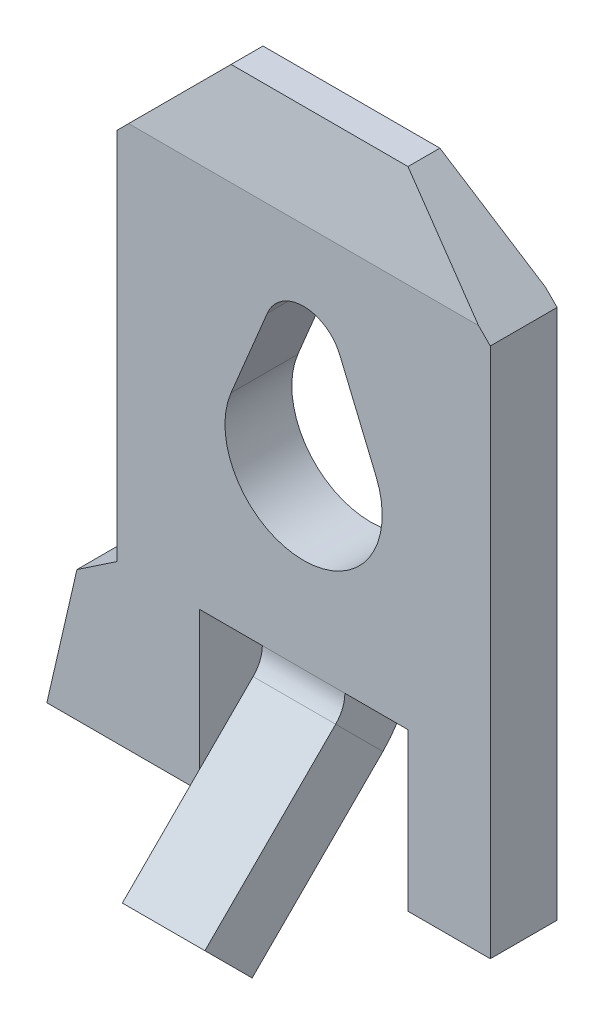
ISO-10303-21;
HEADER;
FILE_DESCRIPTION(('STEP AP214'),'2;1');
FILE_NAME('part.step','',(''),(''),'','','');
FILE_SCHEMA(('AUTOMOTIVE_DESIGN { 1 0 10303 214 1 1 1 1 }'));
ENDSEC;
DATA;
#1=APPLICATION_CONTEXT('core data for automotive mechanical design processes');
#2=APPLICATION_PROTOCOL_DEFINITION('international standard','automotive_design',2000,#1);
#3=PRODUCT_CONTEXT('',#1,'mechanical');
#4=PRODUCT('Part','Part','',(#3));
#5=PRODUCT_RELATED_PRODUCT_CATEGORY('part','',(#4));
#6=PRODUCT_DEFINITION_FORMATION('','',#4);
#7=PRODUCT_DEFINITION_CONTEXT('part definition',#1,'design');
#8=PRODUCT_DEFINITION('design','',#6,#7);
#9=PRODUCT_DEFINITION_SHAPE('','',#8);
#10=(LENGTH_UNIT() NAMED_UNIT(*) SI_UNIT(.MILLI.,.METRE.));
#11=(NAMED_UNIT(*) PLANE_ANGLE_UNIT() SI_UNIT($,.RADIAN.));
#12=(NAMED_UNIT(*) SI_UNIT($,.STERADIAN.) SOLID_ANGLE_UNIT());
#13=UNCERTAINTY_MEASURE_WITH_UNIT(LENGTH_MEASURE(1.E-05),#10,'distance_accuracy_value','');
#14=(GEOMETRIC_REPRESENTATION_CONTEXT(3) GLOBAL_UNCERTAINTY_ASSIGNED_CONTEXT((#13)) GLOBAL_UNIT_ASSIGNED_CONTEXT((#10,
#11,#12)) REPRESENTATION_CONTEXT('',''));
#15=CARTESIAN_POINT('',(0.,0.,0.));
#16=DIRECTION('',(0.,0.,1.));
#17=DIRECTION('',(1.,0.,0.));
#18=AXIS2_PLACEMENT_3D('',#15,#16,#17);
#19=CARTESIAN_POINT('',(4.75,0.149999999999999,0.));
#20=DIRECTION('',(0.,0.,1.));
#21=DIRECTION('',(0.,-1.,0.));
#22=AXIS2_PLACEMENT_3D('',#19,#20,#21);
#23=PLANE('',#22);
#24=DIRECTION('',(0.384813689288075,-0.922994271128755,0.));
#25=VECTOR('',#24,1.);
#26=CARTESIAN_POINT('',(2.84243697464802,5.82748992853653,0.));
#27=LINE('',#26,#25);
#28=CARTESIAN_POINT('',(2.84243697464802,5.82748992853653,0.));
#29=VERTEX_POINT('',#28);
#30=CARTESIAN_POINT('',(3.29799427112875,4.73481368928808,0.));
#31=VERTEX_POINT('',#30);
#32=EDGE_CURVE('E312',#29,#31,#27,.T.);
#33=ORIENTED_EDGE('',*,*,#32,.F.);
#34=CARTESIAN_POINT('',(2.375,5.65,0.));
#35=DIRECTION('',(0.,0.,1.));
#36=DIRECTION('',(0.,-1.,0.));
#37=AXIS2_PLACEMENT_3D('',#34,#35,#36);
#38=CIRCLE('',#37,0.5);
#39=CARTESIAN_POINT('',(1.91346153846154,5.84230769230769,0.));
#40=VERTEX_POINT('',#39);
#41=EDGE_CURVE('E315',#40,#29,#38,.F.);
#42=ORIENTED_EDGE('',*,*,#41,.F.);
#43=DIRECTION('',(0.384615384615385,0.923076923076923,0.));
#44=VECTOR('',#43,1.);
#45=CARTESIAN_POINT('',(1.91346153846154,5.84230769230769,0.));
#46=LINE('',#45,#44);
#47=CARTESIAN_POINT('',(1.45192307692308,4.73461538461538,0.));
#48=VERTEX_POINT('',#47);
#49=EDGE_CURVE('E317',#48,#40,#46,.T.);
#50=ORIENTED_EDGE('',*,*,#49,.F.);
#51=CARTESIAN_POINT('',(2.375,4.35,0.));
#52=DIRECTION('',(0.,0.,1.));
#53=DIRECTION('',(0.,-1.,0.));
#54=AXIS2_PLACEMENT_3D('',#51,#52,#53);
#55=CIRCLE('',#54,0.999999999999999);
#56=EDGE_CURVE('E309',#31,#48,#55,.F.);
#57=ORIENTED_EDGE('',*,*,#56,.F.);
#58=EDGE_LOOP('',(#33,#42,#50,#57));
#59=FACE_BOUND('',#58,.T.);
#60=DIRECTION('',(1.,0.,0.));
#61=VECTOR('',#60,1.);
#62=CARTESIAN_POINT('',(2.9,2.15,0.));
#63=LINE('',#62,#61);
#64=CARTESIAN_POINT('',(2.9,2.15,0.));
#65=VERTEX_POINT('',#64);
#66=CARTESIAN_POINT('',(3.7,2.15,0.));
#67=VERTEX_POINT('',#66);
#68=EDGE_CURVE('E276',#65,#67,#63,.T.);
#69=ORIENTED_EDGE('',*,*,#68,.F.);
#70=DIRECTION('',(-1.,0.,0.));
#71=VECTOR('',#70,1.);
#72=CARTESIAN_POINT('',(4.75,2.15,0.));
#73=LINE('',#72,#71);
#74=CARTESIAN_POINT('',(1.85000000000001,2.15,0.));
#75=VERTEX_POINT('',#74);
#76=EDGE_CURVE('E51',#65,#75,#73,.T.);
#77=ORIENTED_EDGE('',*,*,#76,.T.);
#78=DIRECTION('',(1.,0.,0.));
#79=VECTOR('',#78,1.);
#80=CARTESIAN_POINT('',(1.85,2.15,0.));
#81=LINE('',#80,#79);
#82=CARTESIAN_POINT('',(1.05,2.15,0.));
#83=VERTEX_POINT('',#82);
#84=EDGE_CURVE('E287',#83,#75,#81,.T.);
#85=ORIENTED_EDGE('',*,*,#84,.F.);
#86=DIRECTION('',(0.,1.,0.));
#87=VECTOR('',#86,1.);
#88=CARTESIAN_POINT('',(1.05,2.15,0.));
#89=LINE('',#88,#87);
#90=CARTESIAN_POINT('',(1.05,0.149999999999999,0.));
#91=VERTEX_POINT('',#90);
#92=EDGE_CURVE('E284',#91,#83,#89,.T.);
#93=ORIENTED_EDGE('',*,*,#92,.F.);
#94=DIRECTION('',(-1.,0.,0.));
#95=VECTOR('',#94,1.);
#96=CARTESIAN_POINT('',(4.75,0.149999999999999,0.));
#97=LINE('',#96,#95);
#98=CARTESIAN_POINT('',(-0.890356386047537,0.149999999999998,0.));
#99=VERTEX_POINT('',#98);
#100=EDGE_CURVE('E381',#91,#99,#97,.T.);
#101=ORIENTED_EDGE('',*,*,#100,.T.);
#102=DIRECTION('',(0.224692209858573,0.974429787531596,0.));
#103=VECTOR('',#102,1.);
#104=CARTESIAN_POINT('',(-0.507898340442458,1.80861785930754,0.));
#105=LINE('',#104,#103);
#106=CARTESIAN_POINT('',(-0.507898340442458,1.80861785930754,0.));
#107=VERTEX_POINT('',#106);
#108=EDGE_CURVE('E230',#99,#107,#105,.T.);
#109=ORIENTED_EDGE('',*,*,#108,.T.);
#110=DIRECTION('',(0.829945240760083,0.557844868525011,0.));
#111=VECTOR('',#110,1.);
#112=CARTESIAN_POINT('',(0.,2.15,0.));
#113=LINE('',#112,#111);
#114=CARTESIAN_POINT('',(0.,2.15,0.));
#115=VERTEX_POINT('',#114);
#116=EDGE_CURVE('E208',#107,#115,#113,.T.);
#117=ORIENTED_EDGE('',*,*,#116,.T.);
#118=DIRECTION('',(0.,1.,0.));
#119=VECTOR('',#118,1.);
#120=CARTESIAN_POINT('',(0.,0.149999999999999,0.));
#121=LINE('',#120,#119);
#122=CARTESIAN_POINT('',(0.,6.9,0.));
#123=VERTEX_POINT('',#122);
#124=EDGE_CURVE('E371',#115,#123,#121,.T.);
#125=ORIENTED_EDGE('',*,*,#124,.T.);
#126=DIRECTION('',(-0.707106781186548,-0.707106781186548,0.));
#127=VECTOR('',#126,1.);
#128=CARTESIAN_POINT('',(0.,6.9,0.));
#129=LINE('',#128,#127);
#130=CARTESIAN_POINT('',(0.15,7.05,0.));
#131=VERTEX_POINT('',#130);
#132=EDGE_CURVE('E345',#131,#123,#129,.T.);
#133=ORIENTED_EDGE('',*,*,#132,.F.);
#134=DIRECTION('',(-1.,0.,0.));
#135=VECTOR('',#134,1.);
#136=CARTESIAN_POINT('',(4.75,7.05,0.));
#137=LINE('',#136,#135);
#138=CARTESIAN_POINT('',(4.6,7.05,0.));
#139=VERTEX_POINT('',#138);
#140=EDGE_CURVE('E376',#139,#131,#137,.T.);
#141=ORIENTED_EDGE('',*,*,#140,.F.);
#142=DIRECTION('',(-0.707106781186548,0.707106781186548,0.));
#143=VECTOR('',#142,1.);
#144=CARTESIAN_POINT('',(3.5,8.15,0.));
#145=LINE('',#144,#143);
#146=CARTESIAN_POINT('',(4.75,6.9,0.));
#147=VERTEX_POINT('',#146);
#148=EDGE_CURVE('E341',#147,#139,#145,.T.);
#149=ORIENTED_EDGE('',*,*,#148,.F.);
#150=DIRECTION('',(0.,1.,0.));
#151=VECTOR('',#150,1.);
#152=CARTESIAN_POINT('',(4.75,0.149999999999999,0.));
#153=LINE('',#152,#151);
#154=CARTESIAN_POINT('',(4.75,0.149999999999999,0.));
#155=VERTEX_POINT('',#154);
#156=EDGE_CURVE('E373',#155,#147,#153,.T.);
#157=ORIENTED_EDGE('',*,*,#156,.F.);
#158=CARTESIAN_POINT('',(3.7,0.149999999999999,0.));
#159=VERTEX_POINT('',#158);
#160=EDGE_CURVE('E382',#155,#159,#97,.T.);
#161=ORIENTED_EDGE('',*,*,#160,.T.);
#162=DIRECTION('',(0.,-1.,0.));
#163=VECTOR('',#162,1.);
#164=CARTESIAN_POINT('',(3.7,2.15,0.));
#165=LINE('',#164,#163);
#166=EDGE_CURVE('E301',#67,#159,#165,.T.);
#167=ORIENTED_EDGE('',*,*,#166,.F.);
#168=EDGE_LOOP('',(#69,#77,#85,#93,#101,#109,#117,#125,#133,#141,#149,#157,#161,#167));
#169=FACE_BOUND('',#168,.T.);
#170=ADVANCED_FACE('F44',(#59,#169),#23,.F.);
#171=CARTESIAN_POINT('',(4.75,7.05,0.85));
#172=DIRECTION('',(0.,0.,-1.));
#173=DIRECTION('',(0.,1.,0.));
#174=AXIS2_PLACEMENT_3D('',#171,#172,#173);
#175=PLANE('',#174);
#176=DIRECTION('',(-0.384615384615385,-0.923076923076923,0.));
#177=VECTOR('',#176,1.);
#178=CARTESIAN_POINT('',(1.91346153846154,5.84230769230769,0.849999999999999));
#179=LINE('',#178,#177);
#180=CARTESIAN_POINT('',(1.91346153846154,5.84230769230769,0.85));
#181=VERTEX_POINT('',#180);
#182=CARTESIAN_POINT('',(1.45192307692308,4.73461538461538,0.849999999999999));
#183=VERTEX_POINT('',#182);
#184=EDGE_CURVE('E319',#181,#183,#179,.T.);
#185=ORIENTED_EDGE('',*,*,#184,.F.);
#186=CARTESIAN_POINT('',(2.375,5.65,0.849999999999999));
#187=DIRECTION('',(0.,0.,1.));
#188=DIRECTION('',(1.,0.,0.));
#189=AXIS2_PLACEMENT_3D('',#186,#187,#188);
#190=CIRCLE('',#189,0.5);
#191=CARTESIAN_POINT('',(2.84243697464802,5.82748992853653,0.849999999999999));
#192=VERTEX_POINT('',#191);
#193=EDGE_CURVE('E295',#192,#181,#190,.T.);
#194=ORIENTED_EDGE('',*,*,#193,.F.);
#195=DIRECTION('',(-0.384813689288075,0.922994271128755,0.));
#196=VECTOR('',#195,1.);
#197=CARTESIAN_POINT('',(2.84243697464802,5.82748992853653,0.849999999999999));
#198=LINE('',#197,#196);
#199=CARTESIAN_POINT('',(3.29799427112875,4.73481368928808,0.849999999999999));
#200=VERTEX_POINT('',#199);
#201=EDGE_CURVE('E325',#200,#192,#198,.T.);
#202=ORIENTED_EDGE('',*,*,#201,.F.);
#203=CARTESIAN_POINT('',(2.375,4.35,0.849999999999999));
#204=DIRECTION('',(0.,0.,1.));
#205=DIRECTION('',(1.,0.,0.));
#206=AXIS2_PLACEMENT_3D('',#203,#204,#205);
#207=CIRCLE('',#206,0.999999999999999);
#208=EDGE_CURVE('E322',#183,#200,#207,.T.);
#209=ORIENTED_EDGE('',*,*,#208,.F.);
#210=EDGE_LOOP('',(#185,#194,#202,#209));
#211=FACE_BOUND('',#210,.T.);
#212=DIRECTION('',(-1.,0.,0.));
#213=VECTOR('',#212,1.);
#214=CARTESIAN_POINT('',(1.85,2.15,0.85));
#215=LINE('',#214,#213);
#216=CARTESIAN_POINT('',(1.85000000000001,2.15,0.849999999999999));
#217=VERTEX_POINT('',#216);
#218=CARTESIAN_POINT('',(1.05,2.15,0.85));
#219=VERTEX_POINT('',#218);
#220=EDGE_CURVE('E280',#217,#219,#215,.T.);
#221=ORIENTED_EDGE('',*,*,#220,.F.);
#222=DIRECTION('',(1.,0.,0.));
#223=VECTOR('',#222,1.);
#224=CARTESIAN_POINT('',(4.75,2.15,0.849999999999999));
#225=LINE('',#224,#223);
#226=CARTESIAN_POINT('',(2.9,2.15,0.849999999999999));
#227=VERTEX_POINT('',#226);
#228=EDGE_CURVE('E398',#217,#227,#225,.T.);
#229=ORIENTED_EDGE('',*,*,#228,.T.);
#230=DIRECTION('',(-1.,0.,0.));
#231=VECTOR('',#230,1.);
#232=CARTESIAN_POINT('',(2.9,2.15,0.85));
#233=LINE('',#232,#231);
#234=CARTESIAN_POINT('',(3.7,2.15,0.85));
#235=VERTEX_POINT('',#234);
#236=EDGE_CURVE('E288',#235,#227,#233,.T.);
#237=ORIENTED_EDGE('',*,*,#236,.F.);
#238=DIRECTION('',(0.,1.,0.));
#239=VECTOR('',#238,1.);
#240=CARTESIAN_POINT('',(3.7,2.15,0.85));
#241=LINE('',#240,#239);
#242=CARTESIAN_POINT('',(3.7,0.149999999999999,0.849999999999999));
#243=VERTEX_POINT('',#242);
#244=EDGE_CURVE('E296',#243,#235,#241,.T.);
#245=ORIENTED_EDGE('',*,*,#244,.F.);
#246=DIRECTION('',(-1.,0.,0.));
#247=VECTOR('',#246,1.);
#248=CARTESIAN_POINT('',(4.75,0.149999999999999,0.849999999999999));
#249=LINE('',#248,#247);
#250=CARTESIAN_POINT('',(4.75,0.149999999999999,0.849999999999999));
#251=VERTEX_POINT('',#250);
#252=EDGE_CURVE('E386',#251,#243,#249,.T.);
#253=ORIENTED_EDGE('',*,*,#252,.F.);
#254=DIRECTION('',(0.,-1.,0.));
#255=VECTOR('',#254,1.);
#256=CARTESIAN_POINT('',(4.75,7.05,0.85));
#257=LINE('',#256,#255);
#258=CARTESIAN_POINT('',(4.75,6.9,0.85));
#259=VERTEX_POINT('',#258);
#260=EDGE_CURVE('E368',#259,#251,#257,.T.);
#261=ORIENTED_EDGE('',*,*,#260,.F.);
#262=DIRECTION('',(0.707106781186548,-0.707106781186548,0.));
#263=VECTOR('',#262,1.);
#264=CARTESIAN_POINT('',(3.5,8.15,0.849999999999999));
#265=LINE('',#264,#263);
#266=CARTESIAN_POINT('',(4.6,7.05,0.849999999999999));
#267=VERTEX_POINT('',#266);
#268=EDGE_CURVE('E337',#267,#259,#265,.T.);
#269=ORIENTED_EDGE('',*,*,#268,.F.);
#270=DIRECTION('',(-1.,0.,0.));
#271=VECTOR('',#270,1.);
#272=CARTESIAN_POINT('',(4.75,7.05,0.85));
#273=LINE('',#272,#271);
#274=CARTESIAN_POINT('',(0.15,7.05,0.849999999999999));
#275=VERTEX_POINT('',#274);
#276=EDGE_CURVE('E389',#267,#275,#273,.T.);
#277=ORIENTED_EDGE('',*,*,#276,.T.);
#278=DIRECTION('',(0.707106781186547,0.707106781186548,0.));
#279=VECTOR('',#278,1.);
#280=CARTESIAN_POINT('',(0.,6.9,0.849999999999999));
#281=LINE('',#280,#279);
#282=CARTESIAN_POINT('',(0.,6.9,0.849999999999999));
#283=VERTEX_POINT('',#282);
#284=EDGE_CURVE('E338',#283,#275,#281,.T.);
#285=ORIENTED_EDGE('',*,*,#284,.F.);
#286=DIRECTION('',(0.,-1.,0.));
#287=VECTOR('',#286,1.);
#288=CARTESIAN_POINT('',(0.,7.05,0.85));
#289=LINE('',#288,#287);
#290=CARTESIAN_POINT('',(0.,2.15,0.849999999999999));
#291=VERTEX_POINT('',#290);
#292=EDGE_CURVE('E227',#283,#291,#289,.T.);
#293=ORIENTED_EDGE('',*,*,#292,.T.);
#294=DIRECTION('',(-0.829945240760083,-0.557844868525011,0.));
#295=VECTOR('',#294,1.);
#296=CARTESIAN_POINT('',(0.,2.15,0.849999999999999));
#297=LINE('',#296,#295);
#298=CARTESIAN_POINT('',(-0.507898340442458,1.80861785930754,0.849999999999999));
#299=VERTEX_POINT('',#298);
#300=EDGE_CURVE('E58',#291,#299,#297,.T.);
#301=ORIENTED_EDGE('',*,*,#300,.T.);
#302=DIRECTION('',(-0.224692209858573,-0.974429787531596,0.));
#303=VECTOR('',#302,1.);
#304=CARTESIAN_POINT('',(-0.507898340442458,1.80861785930754,0.849999999999999));
#305=LINE('',#304,#303);
#306=CARTESIAN_POINT('',(-0.890356386047537,0.149999999999998,0.849999999999999));
#307=VERTEX_POINT('',#306);
#308=EDGE_CURVE('E216',#299,#307,#305,.T.);
#309=ORIENTED_EDGE('',*,*,#308,.T.);
#310=CARTESIAN_POINT('',(1.05,0.149999999999999,0.849999999999999));
#311=VERTEX_POINT('',#310);
#312=EDGE_CURVE('E385',#311,#307,#249,.T.);
#313=ORIENTED_EDGE('',*,*,#312,.F.);
#314=DIRECTION('',(0.,-1.,0.));
#315=VECTOR('',#314,1.);
#316=CARTESIAN_POINT('',(1.05,2.15,0.85));
#317=LINE('',#316,#315);
#318=EDGE_CURVE('E282',#219,#311,#317,.T.);
#319=ORIENTED_EDGE('',*,*,#318,.F.);
#320=EDGE_LOOP('',(#221,#229,#237,#245,#253,#261,#269,#277,#285,#293,#301,#309,#313,#319));
#321=FACE_BOUND('',#320,.T.);
#322=ADVANCED_FACE('F224',(#211,#321),#175,.F.);
#323=CARTESIAN_POINT('',(4.75,0.149999999999999,0.));
#324=DIRECTION('',(0.,1.,0.));
#325=DIRECTION('',(0.,0.,1.));
#326=AXIS2_PLACEMENT_3D('',#323,#324,#325);
#327=PLANE('',#326);
#328=ORIENTED_EDGE('',*,*,#100,.F.);
#329=DIRECTION('',(0.,0.,-1.));
#330=VECTOR('',#329,1.);
#331=CARTESIAN_POINT('',(1.05,0.149999999999999,3.0040659228538));
#332=LINE('',#331,#330);
#333=EDGE_CURVE('E291',#311,#91,#332,.T.);
#334=ORIENTED_EDGE('',*,*,#333,.F.);
#335=ORIENTED_EDGE('',*,*,#312,.T.);
#336=DIRECTION('',(0.,0.,1.));
#337=VECTOR('',#336,1.);
#338=CARTESIAN_POINT('',(-0.890356386047537,0.149999999999998,-2.18923148483107));
#339=LINE('',#338,#337);
#340=EDGE_CURVE('E211',#99,#307,#339,.T.);
#341=ORIENTED_EDGE('',*,*,#340,.F.);
#342=EDGE_LOOP('',(#328,#334,#335,#341));
#343=FACE_BOUND('',#342,.T.);
#344=ADVANCED_FACE('F456',(#343),#327,.F.);
#345=CARTESIAN_POINT('',(4.75,7.05,0.));
#346=DIRECTION('',(0.,-0.214348018272916,0.976757353216485));
#347=DIRECTION('',(0.,-0.976757353216485,-0.214348018272916));
#348=AXIS2_PLACEMENT_3D('',#345,#346,#347);
#349=PLANE('',#348);
#350=ORIENTED_EDGE('',*,*,#140,.T.);
#351=DIRECTION('',(0.698744344369524,0.698744344369524,0.153338457091523));
#352=VECTOR('',#351,1.);
#353=CARTESIAN_POINT('',(2.39592083042662,9.29592083042662,0.492864146468432));
#354=LINE('',#353,#352);
#355=CARTESIAN_POINT('',(1.25,8.15,0.241393442622949));
#356=VERTEX_POINT('',#355);
#357=EDGE_CURVE('E359',#131,#356,#354,.T.);
#358=ORIENTED_EDGE('',*,*,#357,.T.);
#359=DIRECTION('',(-1.,0.,0.));
#360=VECTOR('',#359,1.);
#361=CARTESIAN_POINT('',(4.75,8.15,0.241393442622949));
#362=LINE('',#361,#360);
#363=CARTESIAN_POINT('',(3.5,8.15,0.241393442622949));
#364=VERTEX_POINT('',#363);
#365=EDGE_CURVE('E395',#364,#356,#362,.T.);
#366=ORIENTED_EDGE('',*,*,#365,.F.);
#367=DIRECTION('',(0.698744344369524,-0.698744344369524,-0.153338457091523));
#368=VECTOR('',#367,1.);
#369=CARTESIAN_POINT('',(4.67323654881826,6.97676345118174,-0.0160716569500576));
#370=LINE('',#369,#368);
#371=EDGE_CURVE('E365',#364,#139,#370,.T.);
#372=ORIENTED_EDGE('',*,*,#371,.T.);
#373=EDGE_LOOP('',(#350,#358,#366,#372));
#374=FACE_BOUND('',#373,.T.);
#375=ADVANCED_FACE('F518',(#374),#349,.F.);
#376=CARTESIAN_POINT('',(4.75,8.15,0.241393442622949));
#377=DIRECTION('',(0.,-1.,0.));
#378=DIRECTION('',(0.,0.,-1.));
#379=AXIS2_PLACEMENT_3D('',#376,#377,#378);
#380=PLANE('',#379);
#381=ORIENTED_EDGE('',*,*,#365,.T.);
#382=DIRECTION('',(0.,0.,1.));
#383=VECTOR('',#382,1.);
#384=CARTESIAN_POINT('',(1.25,8.15,-1.76776695296637));
#385=LINE('',#384,#383);
#386=CARTESIAN_POINT('',(1.25,8.15,0.647131147540979));
#387=VERTEX_POINT('',#386);
#388=EDGE_CURVE('E342',#356,#387,#385,.T.);
#389=ORIENTED_EDGE('',*,*,#388,.T.);
#390=DIRECTION('',(-1.,0.,0.));
#391=VECTOR('',#390,1.);
#392=CARTESIAN_POINT('',(4.75,8.15,0.647131147540979));
#393=LINE('',#392,#391);
#394=CARTESIAN_POINT('',(3.5,8.15,0.647131147540979));
#395=VERTEX_POINT('',#394);
#396=EDGE_CURVE('E392',#395,#387,#393,.T.);
#397=ORIENTED_EDGE('',*,*,#396,.F.);
#398=DIRECTION('',(0.,0.,1.));
#399=VECTOR('',#398,1.);
#400=CARTESIAN_POINT('',(3.5,8.15,-1.76776695296637));
#401=LINE('',#400,#399);
#402=EDGE_CURVE('E351',#364,#395,#401,.T.);
#403=ORIENTED_EDGE('',*,*,#402,.F.);
#404=EDGE_LOOP('',(#381,#389,#397,#403));
#405=FACE_BOUND('',#404,.T.);
#406=ADVANCED_FACE('F514',(#405),#380,.F.);
#407=CARTESIAN_POINT('',(4.75,8.15,0.647131147540979));
#408=DIRECTION('',(0.,-0.181367589437408,-0.983415373838371));
#409=DIRECTION('',(0.,0.983415373838371,-0.181367589437408));
#410=AXIS2_PLACEMENT_3D('',#407,#408,#409);
#411=PLANE('',#410);
#412=ORIENTED_EDGE('',*,*,#396,.T.);
#413=DIRECTION('',(-0.70116968993079,-0.70116968993079,0.12931408215937));
#414=VECTOR('',#413,1.);
#415=CARTESIAN_POINT('',(2.97073626927174,9.87073626927174,0.329782245421185));
#416=LINE('',#415,#414);
#417=EDGE_CURVE('E349',#387,#275,#416,.T.);
#418=ORIENTED_EDGE('',*,*,#417,.T.);
#419=ORIENTED_EDGE('',*,*,#276,.F.);
#420=DIRECTION('',(-0.70116968993079,0.70116968993079,-0.12931408215937));
#421=VECTOR('',#420,1.);
#422=CARTESIAN_POINT('',(4.11454866759705,7.53545133240295,0.760470041155192));
#423=LINE('',#422,#421);
#424=EDGE_CURVE('E362',#267,#395,#423,.T.);
#425=ORIENTED_EDGE('',*,*,#424,.T.);
#426=EDGE_LOOP('',(#412,#418,#419,#425));
#427=FACE_BOUND('',#426,.T.);
#428=ADVANCED_FACE('F510',(#427),#411,.F.);
#429=ORIENTED_EDGE('',*,*,#252,.T.);
#430=DIRECTION('',(0.,0.,-1.));
#431=VECTOR('',#430,1.);
#432=CARTESIAN_POINT('',(3.7,0.149999999999999,3.0040659228538));
#433=LINE('',#432,#431);
#434=EDGE_CURVE('E298',#243,#159,#433,.T.);
#435=ORIENTED_EDGE('',*,*,#434,.T.);
#436=ORIENTED_EDGE('',*,*,#160,.F.);
#437=DIRECTION('',(0.,0.,-1.));
#438=VECTOR('',#437,1.);
#439=CARTESIAN_POINT('',(4.75,0.149999999999999,0.));
#440=LINE('',#439,#438);
#441=EDGE_CURVE('E370',#251,#155,#440,.T.);
#442=ORIENTED_EDGE('',*,*,#441,.F.);
#443=EDGE_LOOP('',(#429,#435,#436,#442));
#444=FACE_BOUND('',#443,.T.);
#445=ADVANCED_FACE('F503',(#444),#327,.F.);
#446=CARTESIAN_POINT('',(4.75,0.,0.));
#447=DIRECTION('',(1.,0.,0.));
#448=DIRECTION('',(0.,0.,-1.));
#449=AXIS2_PLACEMENT_3D('',#446,#447,#448);
#450=PLANE('',#449);
#451=DIRECTION('',(0.,0.,1.));
#452=VECTOR('',#451,1.);
#453=CARTESIAN_POINT('',(4.75,6.9,-1.76776695296637));
#454=LINE('',#453,#452);
#455=EDGE_CURVE('E352',#147,#259,#454,.T.);
#456=ORIENTED_EDGE('',*,*,#455,.T.);
#457=ORIENTED_EDGE('',*,*,#260,.T.);
#458=ORIENTED_EDGE('',*,*,#441,.T.);
#459=ORIENTED_EDGE('',*,*,#156,.T.);
#460=EDGE_LOOP('',(#456,#457,#458,#459));
#461=FACE_BOUND('',#460,.T.);
#462=ADVANCED_FACE('F500',(#461),#450,.T.);
#463=CARTESIAN_POINT('',(0.,0.,0.));
#464=DIRECTION('',(1.,0.,0.));
#465=DIRECTION('',(0.,0.,-1.));
#466=AXIS2_PLACEMENT_3D('',#463,#464,#465);
#467=PLANE('',#466);
#468=ORIENTED_EDGE('',*,*,#124,.F.);
#469=DIRECTION('',(0.,0.,1.));
#470=VECTOR('',#469,1.);
#471=CARTESIAN_POINT('',(0.,2.15,-2.18923148483107));
#472=LINE('',#471,#470);
#473=EDGE_CURVE('E212',#115,#291,#472,.T.);
#474=ORIENTED_EDGE('',*,*,#473,.T.);
#475=ORIENTED_EDGE('',*,*,#292,.F.);
#476=DIRECTION('',(0.,0.,1.));
#477=VECTOR('',#476,1.);
#478=CARTESIAN_POINT('',(0.,6.9,-1.76776695296637));
#479=LINE('',#478,#477);
#480=EDGE_CURVE('E340',#123,#283,#479,.T.);
#481=ORIENTED_EDGE('',*,*,#480,.F.);
#482=EDGE_LOOP('',(#468,#474,#475,#481));
#483=FACE_BOUND('',#482,.T.);
#484=ADVANCED_FACE('F495',(#483),#467,.F.);
#485=CARTESIAN_POINT('',(0.,6.9,-1.76776695296637));
#486=DIRECTION('',(0.707106781186548,-0.707106781186548,0.));
#487=DIRECTION('',(0.707106781186548,0.707106781186548,0.));
#488=AXIS2_PLACEMENT_3D('',#485,#486,#487);
#489=PLANE('',#488);
#490=ORIENTED_EDGE('',*,*,#132,.T.);
#491=ORIENTED_EDGE('',*,*,#480,.T.);
#492=ORIENTED_EDGE('',*,*,#284,.T.);
#493=ORIENTED_EDGE('',*,*,#417,.F.);
#494=ORIENTED_EDGE('',*,*,#388,.F.);
#495=ORIENTED_EDGE('',*,*,#357,.F.);
#496=EDGE_LOOP('',(#490,#491,#492,#493,#494,#495));
#497=FACE_BOUND('',#496,.T.);
#498=ADVANCED_FACE('F492',(#497),#489,.F.);
#499=CARTESIAN_POINT('',(3.5,8.15,-1.76776695296637));
#500=DIRECTION('',(-0.707106781186547,-0.707106781186547,0.));
#501=DIRECTION('',(0.707106781186548,-0.707106781186548,0.));
#502=AXIS2_PLACEMENT_3D('',#499,#500,#501);
#503=PLANE('',#502);
#504=ORIENTED_EDGE('',*,*,#402,.T.);
#505=ORIENTED_EDGE('',*,*,#424,.F.);
#506=ORIENTED_EDGE('',*,*,#268,.T.);
#507=ORIENTED_EDGE('',*,*,#455,.F.);
#508=ORIENTED_EDGE('',*,*,#148,.T.);
#509=ORIENTED_EDGE('',*,*,#371,.F.);
#510=EDGE_LOOP('',(#504,#505,#506,#507,#508,#509));
#511=FACE_BOUND('',#510,.T.);
#512=ADVANCED_FACE('F491',(#511),#503,.F.);
#513=CARTESIAN_POINT('',(2.375,5.65,-3.44093010681705));
#514=DIRECTION('',(0.,0.,1.));
#515=DIRECTION('',(1.,0.,0.));
#516=AXIS2_PLACEMENT_3D('',#513,#514,#515);
#517=CYLINDRICAL_SURFACE('',#516,0.5);
#518=ORIENTED_EDGE('',*,*,#41,.T.);
#519=DIRECTION('',(0.,0.,1.));
#520=VECTOR('',#519,1.);
#521=CARTESIAN_POINT('',(2.84243697464802,5.82748992853653,-3.44093010681705));
#522=LINE('',#521,#520);
#523=EDGE_CURVE('E313',#29,#192,#522,.T.);
#524=ORIENTED_EDGE('',*,*,#523,.T.);
#525=ORIENTED_EDGE('',*,*,#193,.T.);
#526=DIRECTION('',(0.,0.,1.));
#527=VECTOR('',#526,1.);
#528=CARTESIAN_POINT('',(1.91346153846154,5.84230769230769,-3.44093010681705));
#529=LINE('',#528,#527);
#530=EDGE_CURVE('E328',#40,#181,#529,.T.);
#531=ORIENTED_EDGE('',*,*,#530,.F.);
#532=EDGE_LOOP('',(#518,#524,#525,#531));
#533=FACE_BOUND('',#532,.T.);
#534=ADVANCED_FACE('F474',(#533),#517,.F.);
#535=CARTESIAN_POINT('',(2.84243697464802,5.82748992853653,-3.44093010681705));
#536=DIRECTION('',(0.922994271128755,0.384813689288075,0.));
#537=DIRECTION('',(-0.384813689288075,0.922994271128755,0.));
#538=AXIS2_PLACEMENT_3D('',#535,#536,#537);
#539=PLANE('',#538);
#540=ORIENTED_EDGE('',*,*,#32,.T.);
#541=DIRECTION('',(0.,0.,1.));
#542=VECTOR('',#541,1.);
#543=CARTESIAN_POINT('',(3.29799427112875,4.73481368928808,-3.44093010681705));
#544=LINE('',#543,#542);
#545=EDGE_CURVE('E330',#31,#200,#544,.T.);
#546=ORIENTED_EDGE('',*,*,#545,.T.);
#547=ORIENTED_EDGE('',*,*,#201,.T.);
#548=ORIENTED_EDGE('',*,*,#523,.F.);
#549=EDGE_LOOP('',(#540,#546,#547,#548));
#550=FACE_BOUND('',#549,.T.);
#551=ADVANCED_FACE('F465',(#550),#539,.F.);
#552=CARTESIAN_POINT('',(2.375,4.35,-3.44093010681705));
#553=DIRECTION('',(0.,0.,1.));
#554=DIRECTION('',(1.,0.,0.));
#555=AXIS2_PLACEMENT_3D('',#552,#553,#554);
#556=CYLINDRICAL_SURFACE('',#555,0.999999999999999);
#557=ORIENTED_EDGE('',*,*,#56,.T.);
#558=DIRECTION('',(0.,0.,1.));
#559=VECTOR('',#558,1.);
#560=CARTESIAN_POINT('',(1.45192307692308,4.73461538461538,-3.44093010681705));
#561=LINE('',#560,#559);
#562=EDGE_CURVE('E332',#48,#183,#561,.T.);
#563=ORIENTED_EDGE('',*,*,#562,.T.);
#564=ORIENTED_EDGE('',*,*,#208,.T.);
#565=ORIENTED_EDGE('',*,*,#545,.F.);
#566=EDGE_LOOP('',(#557,#563,#564,#565));
#567=FACE_BOUND('',#566,.T.);
#568=ADVANCED_FACE('F467',(#567),#556,.F.);
#569=CARTESIAN_POINT('',(1.91346153846154,5.84230769230769,-3.44093010681705));
#570=DIRECTION('',(-0.923076923076923,0.384615384615385,0.));
#571=DIRECTION('',(-0.384615384615385,-0.923076923076923,0.));
#572=AXIS2_PLACEMENT_3D('',#569,#570,#571);
#573=PLANE('',#572);
#574=ORIENTED_EDGE('',*,*,#49,.T.);
#575=ORIENTED_EDGE('',*,*,#530,.T.);
#576=ORIENTED_EDGE('',*,*,#184,.T.);
#577=ORIENTED_EDGE('',*,*,#562,.F.);
#578=EDGE_LOOP('',(#574,#575,#576,#577));
#579=FACE_BOUND('',#578,.T.);
#580=ADVANCED_FACE('F476',(#579),#573,.F.);
#581=CARTESIAN_POINT('',(3.7,2.15,3.0040659228538));
#582=DIRECTION('',(1.,0.,0.));
#583=DIRECTION('',(0.,1.,0.));
#584=AXIS2_PLACEMENT_3D('',#581,#582,#583);
#585=PLANE('',#584);
#586=ORIENTED_EDGE('',*,*,#244,.T.);
#587=DIRECTION('',(0.,0.,-1.));
#588=VECTOR('',#587,1.);
#589=CARTESIAN_POINT('',(3.7,2.15,3.0040659228538));
#590=LINE('',#589,#588);
#591=EDGE_CURVE('E303',#235,#67,#590,.T.);
#592=ORIENTED_EDGE('',*,*,#591,.T.);
#593=ORIENTED_EDGE('',*,*,#166,.T.);
#594=ORIENTED_EDGE('',*,*,#434,.F.);
#595=EDGE_LOOP('',(#586,#592,#593,#594));
#596=FACE_BOUND('',#595,.T.);
#597=ADVANCED_FACE('F478',(#596),#585,.F.);
#598=CARTESIAN_POINT('',(2.9,2.15,3.0040659228538));
#599=DIRECTION('',(0.,1.,0.));
#600=DIRECTION('',(-1.,0.,0.));
#601=AXIS2_PLACEMENT_3D('',#598,#599,#600);
#602=PLANE('',#601);
#603=ORIENTED_EDGE('',*,*,#236,.T.);
#604=DIRECTION('',(0.,0.,-1.));
#605=VECTOR('',#604,1.);
#606=CARTESIAN_POINT('',(2.9,2.15,3.0040659228538));
#607=LINE('',#606,#605);
#608=EDGE_CURVE('E12',#227,#65,#607,.T.);
#609=ORIENTED_EDGE('',*,*,#608,.T.);
#610=ORIENTED_EDGE('',*,*,#68,.T.);
#611=ORIENTED_EDGE('',*,*,#591,.F.);
#612=EDGE_LOOP('',(#603,#609,#610,#611));
#613=FACE_BOUND('',#612,.T.);
#614=ADVANCED_FACE('F409',(#613),#602,.F.);
#615=CARTESIAN_POINT('',(1.85,2.15,3.0040659228538));
#616=DIRECTION('',(0.,1.,0.));
#617=DIRECTION('',(0.,0.,1.));
#618=AXIS2_PLACEMENT_3D('',#615,#616,#617);
#619=PLANE('',#618);
#620=ORIENTED_EDGE('',*,*,#220,.T.);
#621=DIRECTION('',(0.,0.,-1.));
#622=VECTOR('',#621,1.);
#623=CARTESIAN_POINT('',(1.05,2.15,3.0040659228538));
#624=LINE('',#623,#622);
#625=EDGE_CURVE('E283',#219,#83,#624,.T.);
#626=ORIENTED_EDGE('',*,*,#625,.T.);
#627=ORIENTED_EDGE('',*,*,#84,.T.);
#628=DIRECTION('',(0.,0.,-1.));
#629=VECTOR('',#628,1.);
#630=CARTESIAN_POINT('',(1.85,2.15,3.0040659228538));
#631=LINE('',#630,#629);
#632=EDGE_CURVE('E401',#217,#75,#631,.T.);
#633=ORIENTED_EDGE('',*,*,#632,.F.);
#634=EDGE_LOOP('',(#620,#626,#627,#633));
#635=FACE_BOUND('',#634,.T.);
#636=ADVANCED_FACE('F422',(#635),#619,.F.);
#637=CARTESIAN_POINT('',(1.05,2.15,3.0040659228538));
#638=DIRECTION('',(-1.,0.,0.));
#639=DIRECTION('',(0.,-1.,0.));
#640=AXIS2_PLACEMENT_3D('',#637,#638,#639);
#641=PLANE('',#640);
#642=ORIENTED_EDGE('',*,*,#318,.T.);
#643=ORIENTED_EDGE('',*,*,#333,.T.);
#644=ORIENTED_EDGE('',*,*,#92,.T.);
#645=ORIENTED_EDGE('',*,*,#625,.F.);
#646=EDGE_LOOP('',(#642,#643,#644,#645));
#647=FACE_BOUND('',#646,.T.);
#648=ADVANCED_FACE('F544',(#647),#641,.F.);
#649=CARTESIAN_POINT('',(1.85,2.15,1.25));
#650=DIRECTION('',(1.,0.,0.));
#651=DIRECTION('',(0.,1.,0.));
#652=AXIS2_PLACEMENT_3D('',#649,#650,#651);
#653=PLANE('',#652);
#654=ORIENTED_EDGE('',*,*,#632,.T.);
#655=CARTESIAN_POINT('',(1.85000000000001,2.15,1.25));
#656=DIRECTION('',(1.,0.,0.));
#657=DIRECTION('',(0.,1.,0.));
#658=AXIS2_PLACEMENT_3D('',#655,#656,#657);
#659=CIRCLE('',#658,1.25);
#660=CARTESIAN_POINT('',(1.85,1.26611652351682,0.366116523516817));
#661=VERTEX_POINT('',#660);
#662=EDGE_CURVE('E238',#75,#661,#659,.F.);
#663=ORIENTED_EDGE('',*,*,#662,.T.);
#664=DIRECTION('',(0.,0.707106781186544,0.707106781186551));
#665=VECTOR('',#664,1.);
#666=CARTESIAN_POINT('',(1.85,3.39031190869815,2.49031190869817));
#667=LINE('',#666,#665);
#668=CARTESIAN_POINT('',(1.85,1.86715728752538,0.967157287525381));
#669=VERTEX_POINT('',#668);
#670=EDGE_CURVE('E258',#661,#669,#667,.T.);
#671=ORIENTED_EDGE('',*,*,#670,.T.);
#672=CARTESIAN_POINT('',(1.85,2.15,1.25));
#673=DIRECTION('',(-1.,0.,0.));
#674=DIRECTION('',(0.,1.,0.));
#675=AXIS2_PLACEMENT_3D('',#672,#673,#674);
#676=CIRCLE('',#675,0.4);
#677=EDGE_CURVE('E269',#217,#669,#676,.T.);
#678=ORIENTED_EDGE('',*,*,#677,.F.);
#679=EDGE_LOOP('',(#654,#663,#671,#678));
#680=FACE_BOUND('',#679,.T.);
#681=ADVANCED_FACE('F424',(#680),#653,.F.);
#682=CARTESIAN_POINT('',(2.9,2.15,1.25));
#683=DIRECTION('',(-1.,0.,0.));
#684=DIRECTION('',(0.,0.,1.));
#685=AXIS2_PLACEMENT_3D('',#682,#683,#684);
#686=PLANE('',#685);
#687=DIRECTION('',(0.,-0.707106781186544,-0.707106781186551));
#688=VECTOR('',#687,1.);
#689=CARTESIAN_POINT('',(2.9,3.39031190869815,2.49031190869817));
#690=LINE('',#689,#688);
#691=CARTESIAN_POINT('',(2.9,1.86715728752538,0.96715728752538));
#692=VERTEX_POINT('',#691);
#693=CARTESIAN_POINT('',(2.9,1.26611652351682,0.366116523516817));
#694=VERTEX_POINT('',#693);
#695=EDGE_CURVE('E264',#692,#694,#690,.T.);
#696=ORIENTED_EDGE('',*,*,#695,.T.);
#697=CARTESIAN_POINT('',(2.9,2.15,1.25));
#698=DIRECTION('',(1.,0.,0.));
#699=DIRECTION('',(0.,1.,0.));
#700=AXIS2_PLACEMENT_3D('',#697,#698,#699);
#701=CIRCLE('',#700,1.25);
#702=EDGE_CURVE('E273',#694,#65,#701,.T.);
#703=ORIENTED_EDGE('',*,*,#702,.T.);
#704=ORIENTED_EDGE('',*,*,#608,.F.);
#705=CARTESIAN_POINT('',(2.9,2.15,1.25));
#706=DIRECTION('',(1.,0.,0.));
#707=DIRECTION('',(0.,0.,1.));
#708=AXIS2_PLACEMENT_3D('',#705,#706,#707);
#709=CIRCLE('',#708,0.4);
#710=EDGE_CURVE('E272',#692,#227,#709,.T.);
#711=ORIENTED_EDGE('',*,*,#710,.F.);
#712=EDGE_LOOP('',(#696,#703,#704,#711));
#713=FACE_BOUND('',#712,.T.);
#714=ADVANCED_FACE('F413',(#713),#686,.F.);
#715=CARTESIAN_POINT('',(0.876719746353102,2.15,1.25));
#716=DIRECTION('',(1.,0.,0.));
#717=DIRECTION('',(0.,1.,0.));
#718=AXIS2_PLACEMENT_3D('',#715,#716,#717);
#719=CYLINDRICAL_SURFACE('',#718,0.4);
#720=ORIENTED_EDGE('',*,*,#710,.T.);
#721=ORIENTED_EDGE('',*,*,#228,.F.);
#722=ORIENTED_EDGE('',*,*,#677,.T.);
#723=DIRECTION('',(1.,0.,0.));
#724=VECTOR('',#723,1.);
#725=CARTESIAN_POINT('',(4.75,1.86715728752538,0.967157287525383));
#726=LINE('',#725,#724);
#727=EDGE_CURVE('E235',#669,#692,#726,.T.);
#728=ORIENTED_EDGE('',*,*,#727,.T.);
#729=EDGE_LOOP('',(#720,#721,#722,#728));
#730=FACE_BOUND('',#729,.T.);
#731=ADVANCED_FACE('F416',(#730),#719,.F.);
#732=CARTESIAN_POINT('',(0.876719746353102,2.15,1.25));
#733=DIRECTION('',(1.,0.,0.));
#734=DIRECTION('',(0.,1.,0.));
#735=AXIS2_PLACEMENT_3D('',#732,#733,#734);
#736=CYLINDRICAL_SURFACE('',#735,1.25);
#737=ORIENTED_EDGE('',*,*,#702,.F.);
#738=DIRECTION('',(-1.,0.,0.));
#739=VECTOR('',#738,1.);
#740=CARTESIAN_POINT('',(4.75,1.26611652351682,0.366116523516814));
#741=LINE('',#740,#739);
#742=EDGE_CURVE('E261',#694,#661,#741,.T.);
#743=ORIENTED_EDGE('',*,*,#742,.T.);
#744=ORIENTED_EDGE('',*,*,#662,.F.);
#745=ORIENTED_EDGE('',*,*,#76,.F.);
#746=EDGE_LOOP('',(#737,#743,#744,#745));
#747=FACE_BOUND('',#746,.T.);
#748=ADVANCED_FACE('F425',(#747),#736,.T.);
#749=CARTESIAN_POINT('',(0.,-0.397031517045243,2.02926456407888));
#750=DIRECTION('',(0.,-0.707106781186546,0.707106781186549));
#751=DIRECTION('',(0.,-0.707106781186549,-0.707106781186546));
#752=AXIS2_PLACEMENT_3D('',#749,#750,#751);
#753=PLANE('',#752);
#754=DIRECTION('',(0.,0.707106781186549,0.707106781186546));
#755=VECTOR('',#754,1.);
#756=CARTESIAN_POINT('',(2.9,-0.397031517045244,2.02926456407888));
#757=LINE('',#756,#755);
#758=CARTESIAN_POINT('',(2.9,-0.397031517045244,2.02926456407888));
#759=VERTEX_POINT('',#758);
#760=CARTESIAN_POINT('',(2.9,0.204009246963322,2.63030532808745));
#761=VERTEX_POINT('',#760);
#762=EDGE_CURVE('E255',#759,#761,#757,.T.);
#763=ORIENTED_EDGE('',*,*,#762,.T.);
#764=DIRECTION('',(-1.,0.,0.));
#765=VECTOR('',#764,1.);
#766=CARTESIAN_POINT('',(2.9,0.204009246963322,2.63030532808745));
#767=LINE('',#766,#765);
#768=CARTESIAN_POINT('',(1.85,0.204009246963323,2.63030532808745));
#769=VERTEX_POINT('',#768);
#770=EDGE_CURVE('E252',#761,#769,#767,.T.);
#771=ORIENTED_EDGE('',*,*,#770,.T.);
#772=DIRECTION('',(0.,-0.707106781186549,-0.707106781186546));
#773=VECTOR('',#772,1.);
#774=CARTESIAN_POINT('',(1.85,0.204009246963323,2.63030532808745));
#775=LINE('',#774,#773);
#776=CARTESIAN_POINT('',(1.85,-0.397031517045243,2.02926456407888));
#777=VERTEX_POINT('',#776);
#778=EDGE_CURVE('E249',#769,#777,#775,.T.);
#779=ORIENTED_EDGE('',*,*,#778,.T.);
#780=DIRECTION('',(1.,0.,0.));
#781=VECTOR('',#780,1.);
#782=CARTESIAN_POINT('',(1.85,-0.397031517045243,2.02926456407888));
#783=LINE('',#782,#781);
#784=EDGE_CURVE('E246',#777,#759,#783,.T.);
#785=ORIENTED_EDGE('',*,*,#784,.T.);
#786=EDGE_LOOP('',(#763,#771,#779,#785));
#787=FACE_BOUND('',#786,.T.);
#788=ADVANCED_FACE('F440',(#787),#753,.T.);
#789=CARTESIAN_POINT('',(4.75,5.79015281833704,-2.95583824328629));
#790=DIRECTION('',(0.,-0.707106781186549,-0.707106781186546));
#791=DIRECTION('',(0.,0.707106781186546,-0.707106781186549));
#792=AXIS2_PLACEMENT_3D('',#789,#790,#791);
#793=PLANE('',#792);
#794=ORIENTED_EDGE('',*,*,#727,.F.);
#795=DIRECTION('',(0.,0.707106781186546,-0.707106781186549));
#796=VECTOR('',#795,1.);
#797=CARTESIAN_POINT('',(1.85,2.32532959052296,0.508984984527799));
#798=LINE('',#797,#796);
#799=EDGE_CURVE('E241',#769,#669,#798,.T.);
#800=ORIENTED_EDGE('',*,*,#799,.F.);
#801=ORIENTED_EDGE('',*,*,#770,.F.);
#802=DIRECTION('',(0.,-0.707106781186546,0.707106781186549));
#803=VECTOR('',#802,1.);
#804=CARTESIAN_POINT('',(2.9,2.32532959052296,0.508984984527799));
#805=LINE('',#804,#803);
#806=EDGE_CURVE('E239',#692,#761,#805,.T.);
#807=ORIENTED_EDGE('',*,*,#806,.F.);
#808=EDGE_LOOP('',(#794,#800,#801,#807));
#809=FACE_BOUND('',#808,.T.);
#810=ADVANCED_FACE('F437',(#809),#793,.F.);
#811=CARTESIAN_POINT('',(1.85,3.84848421169575,2.03213960570058));
#812=DIRECTION('',(1.,0.,0.));
#813=DIRECTION('',(0.,-0.707106781186549,-0.707106781186546));
#814=AXIS2_PLACEMENT_3D('',#811,#812,#813);
#815=PLANE('',#814);
#816=ORIENTED_EDGE('',*,*,#670,.F.);
#817=DIRECTION('',(0.,-0.707106781186546,0.707106781186549));
#818=VECTOR('',#817,1.);
#819=CARTESIAN_POINT('',(1.85,1.7242888265144,-0.0920557794807644));
#820=LINE('',#819,#818);
#821=EDGE_CURVE('E244',#661,#777,#820,.T.);
#822=ORIENTED_EDGE('',*,*,#821,.T.);
#823=ORIENTED_EDGE('',*,*,#778,.F.);
#824=ORIENTED_EDGE('',*,*,#799,.T.);
#825=EDGE_LOOP('',(#816,#822,#823,#824));
#826=FACE_BOUND('',#825,.T.);
#827=ADVANCED_FACE('F442',(#826),#815,.F.);
#828=CARTESIAN_POINT('',(4.75,0.310075264141302,1.32215778289233));
#829=DIRECTION('',(0.,0.707106781186549,0.707106781186546));
#830=DIRECTION('',(0.,-0.707106781186546,0.707106781186549));
#831=AXIS2_PLACEMENT_3D('',#828,#829,#830);
#832=PLANE('',#831);
#833=ORIENTED_EDGE('',*,*,#742,.F.);
#834=DIRECTION('',(0.,0.707106781186546,-0.707106781186549));
#835=VECTOR('',#834,1.);
#836=CARTESIAN_POINT('',(2.9,1.7242888265144,-0.0920557794807646));
#837=LINE('',#836,#835);
#838=EDGE_CURVE('E236',#759,#694,#837,.T.);
#839=ORIENTED_EDGE('',*,*,#838,.F.);
#840=ORIENTED_EDGE('',*,*,#784,.F.);
#841=ORIENTED_EDGE('',*,*,#821,.F.);
#842=EDGE_LOOP('',(#833,#839,#840,#841));
#843=FACE_BOUND('',#842,.T.);
#844=ADVANCED_FACE('F428',(#843),#832,.F.);
#845=CARTESIAN_POINT('',(2.9,3.84848421169575,2.03213960570058));
#846=DIRECTION('',(-1.,0.,0.));
#847=DIRECTION('',(0.,-0.707106781186546,0.707106781186549));
#848=AXIS2_PLACEMENT_3D('',#845,#846,#847);
#849=PLANE('',#848);
#850=ORIENTED_EDGE('',*,*,#695,.F.);
#851=ORIENTED_EDGE('',*,*,#806,.T.);
#852=ORIENTED_EDGE('',*,*,#762,.F.);
#853=ORIENTED_EDGE('',*,*,#838,.T.);
#854=EDGE_LOOP('',(#850,#851,#852,#853));
#855=FACE_BOUND('',#854,.T.);
#856=ADVANCED_FACE('F433',(#855),#849,.F.);
#857=CARTESIAN_POINT('',(-0.507898340442458,1.80861785930754,-2.18923148483107));
#858=DIRECTION('',(-0.974429787531596,0.224692209858573,0.));
#859=DIRECTION('',(-0.224692209858573,-0.974429787531596,0.));
#860=AXIS2_PLACEMENT_3D('',#857,#858,#859);
#861=PLANE('',#860);
#862=ORIENTED_EDGE('',*,*,#108,.F.);
#863=ORIENTED_EDGE('',*,*,#340,.T.);
#864=ORIENTED_EDGE('',*,*,#308,.F.);
#865=DIRECTION('',(0.,0.,1.));
#866=VECTOR('',#865,1.);
#867=CARTESIAN_POINT('',(-0.507898340442458,1.80861785930754,-2.18923148483107));
#868=LINE('',#867,#866);
#869=EDGE_CURVE('E205',#107,#299,#868,.T.);
#870=ORIENTED_EDGE('',*,*,#869,.F.);
#871=EDGE_LOOP('',(#862,#863,#864,#870));
#872=FACE_BOUND('',#871,.T.);
#873=ADVANCED_FACE('F217',(#872),#861,.T.);
#874=CARTESIAN_POINT('',(0.,2.15,-2.18923148483107));
#875=DIRECTION('',(-0.557844868525011,0.829945240760083,0.));
#876=DIRECTION('',(-0.829945240760083,-0.557844868525011,0.));
#877=AXIS2_PLACEMENT_3D('',#874,#875,#876);
#878=PLANE('',#877);
#879=ORIENTED_EDGE('',*,*,#116,.F.);
#880=ORIENTED_EDGE('',*,*,#869,.T.);
#881=ORIENTED_EDGE('',*,*,#300,.F.);
#882=ORIENTED_EDGE('',*,*,#473,.F.);
#883=EDGE_LOOP('',(#879,#880,#881,#882));
#884=FACE_BOUND('',#883,.T.);
#885=ADVANCED_FACE('F207',(#884),#878,.T.);
#886=CLOSED_SHELL('',(#170,#322,#344,#375,#406,#428,#445,#462,#484,#498,#512,#534,#551,#568,
#580,#597,#614,#636,#648,#681,#714,#731,#748,#788,#810,#827,#844,#856,#873,#885));
#887=MANIFOLD_SOLID_BREP('B2',#886);
#888=ADVANCED_BREP_SHAPE_REPRESENTATION('',(#18,#887),#14);
#889=SHAPE_DEFINITION_REPRESENTATION(#9,#888);
ENDSEC;
END-ISO-10303-21;
